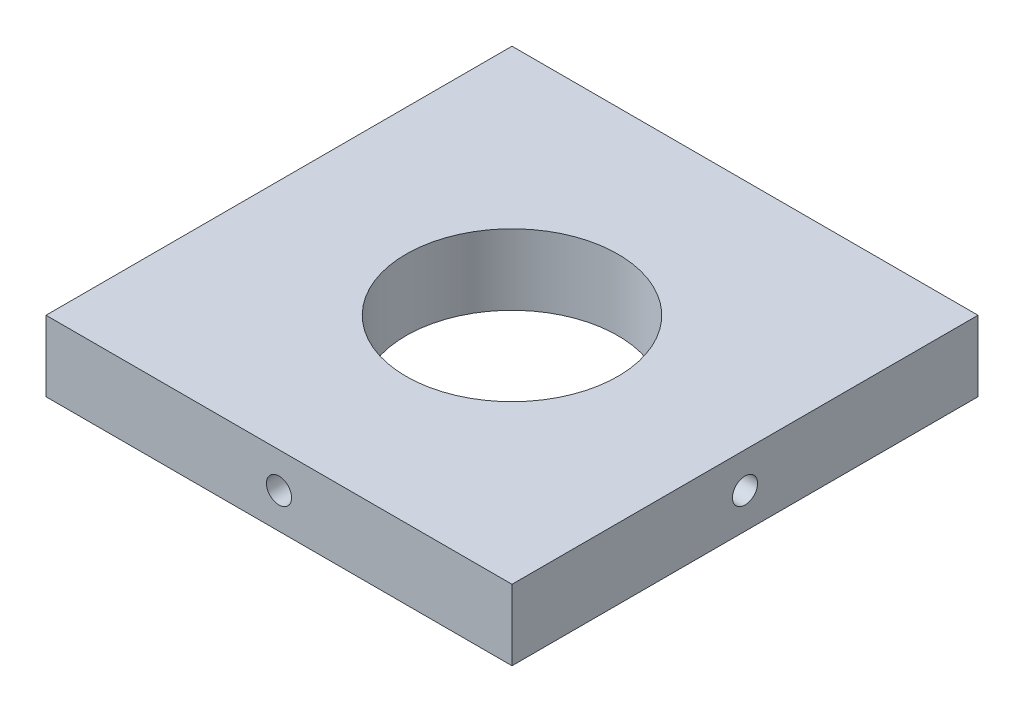
ISO-10303-21;
HEADER;
FILE_DESCRIPTION(('STEP AP214'),'2;1');
FILE_NAME('part.step','',(''),(''),'','','');
FILE_SCHEMA(('AUTOMOTIVE_DESIGN { 1 0 10303 214 1 1 1 1 }'));
ENDSEC;
DATA;
#1=APPLICATION_CONTEXT('core data for automotive mechanical design processes');
#2=APPLICATION_PROTOCOL_DEFINITION('international standard','automotive_design',2000,#1);
#3=PRODUCT_CONTEXT('',#1,'mechanical');
#4=PRODUCT('Part','Part','',(#3));
#5=PRODUCT_RELATED_PRODUCT_CATEGORY('part','',(#4));
#6=PRODUCT_DEFINITION_FORMATION('','',#4);
#7=PRODUCT_DEFINITION_CONTEXT('part definition',#1,'design');
#8=PRODUCT_DEFINITION('design','',#6,#7);
#9=PRODUCT_DEFINITION_SHAPE('','',#8);
#10=(LENGTH_UNIT() NAMED_UNIT(*) SI_UNIT(.MILLI.,.METRE.));
#11=(NAMED_UNIT(*) PLANE_ANGLE_UNIT() SI_UNIT($,.RADIAN.));
#12=(NAMED_UNIT(*) SI_UNIT($,.STERADIAN.) SOLID_ANGLE_UNIT());
#13=UNCERTAINTY_MEASURE_WITH_UNIT(LENGTH_MEASURE(1.E-05),#10,'distance_accuracy_value','');
#14=(GEOMETRIC_REPRESENTATION_CONTEXT(3) GLOBAL_UNCERTAINTY_ASSIGNED_CONTEXT((#13)) GLOBAL_UNIT_ASSIGNED_CONTEXT((#10,
#11,#12)) REPRESENTATION_CONTEXT('',''));
#15=CARTESIAN_POINT('',(0.,0.,0.));
#16=DIRECTION('',(0.,0.,1.));
#17=DIRECTION('',(1.,0.,0.));
#18=AXIS2_PLACEMENT_3D('',#15,#16,#17);
#19=CARTESIAN_POINT('',(0.,5.,0.));
#20=DIRECTION('',(0.,-1.,0.));
#21=DIRECTION('',(0.,0.,-1.));
#22=AXIS2_PLACEMENT_3D('',#19,#20,#21);
#23=PLANE('',#22);
#24=DIRECTION('',(0.,0.,1.));
#25=VECTOR('',#24,1.);
#26=CARTESIAN_POINT('',(-16.5,5.,16.5));
#27=LINE('',#26,#25);
#28=CARTESIAN_POINT('',(-16.5,5.,-16.5));
#29=VERTEX_POINT('',#28);
#30=CARTESIAN_POINT('',(-16.5,5.,16.5));
#31=VERTEX_POINT('',#30);
#32=EDGE_CURVE('E157',#29,#31,#27,.T.);
#33=ORIENTED_EDGE('',*,*,#32,.T.);
#34=DIRECTION('',(1.,0.,0.));
#35=VECTOR('',#34,1.);
#36=CARTESIAN_POINT('',(-16.5,5.,16.5));
#37=LINE('',#36,#35);
#38=CARTESIAN_POINT('',(16.5,5.,16.5));
#39=VERTEX_POINT('',#38);
#40=EDGE_CURVE('E93',#31,#39,#37,.T.);
#41=ORIENTED_EDGE('',*,*,#40,.T.);
#42=DIRECTION('',(0.,0.,-1.));
#43=VECTOR('',#42,1.);
#44=CARTESIAN_POINT('',(16.5,5.,16.5));
#45=LINE('',#44,#43);
#46=CARTESIAN_POINT('',(16.5,5.,-16.5));
#47=VERTEX_POINT('',#46);
#48=EDGE_CURVE('E162',#39,#47,#45,.T.);
#49=ORIENTED_EDGE('',*,*,#48,.T.);
#50=DIRECTION('',(-1.,0.,0.));
#51=VECTOR('',#50,1.);
#52=CARTESIAN_POINT('',(-16.5,5.,-16.5));
#53=LINE('',#52,#51);
#54=EDGE_CURVE('E62',#47,#29,#53,.T.);
#55=ORIENTED_EDGE('',*,*,#54,.T.);
#56=EDGE_LOOP('',(#33,#41,#49,#55));
#57=FACE_BOUND('',#56,.T.);
#58=CARTESIAN_POINT('',(0.,5.,0.));
#59=DIRECTION('',(0.,1.,0.));
#60=DIRECTION('',(0.,0.,1.));
#61=AXIS2_PLACEMENT_3D('',#58,#59,#60);
#62=CIRCLE('',#61,7.5);
#63=CARTESIAN_POINT('',(0.,5.,7.5));
#64=VERTEX_POINT('',#63);
#65=EDGE_CURVE('E149',#64,#64,#62,.T.);
#66=ORIENTED_EDGE('',*,*,#65,.F.);
#67=EDGE_LOOP('',(#66));
#68=FACE_BOUND('',#67,.T.);
#69=ADVANCED_FACE('F44',(#57,#68),#23,.F.);
#70=CARTESIAN_POINT('',(0.,0.,0.));
#71=DIRECTION('',(0.,-1.,0.));
#72=DIRECTION('',(0.,0.,-1.));
#73=AXIS2_PLACEMENT_3D('',#70,#71,#72);
#74=PLANE('',#73);
#75=DIRECTION('',(0.,0.,1.));
#76=VECTOR('',#75,1.);
#77=CARTESIAN_POINT('',(-16.5,0.,16.5));
#78=LINE('',#77,#76);
#79=CARTESIAN_POINT('',(-16.5,0.,-16.5));
#80=VERTEX_POINT('',#79);
#81=CARTESIAN_POINT('',(-16.5,0.,16.5));
#82=VERTEX_POINT('',#81);
#83=EDGE_CURVE('E153',#80,#82,#78,.T.);
#84=ORIENTED_EDGE('',*,*,#83,.F.);
#85=DIRECTION('',(-1.,0.,0.));
#86=VECTOR('',#85,1.);
#87=CARTESIAN_POINT('',(-16.5,0.,-16.5));
#88=LINE('',#87,#86);
#89=CARTESIAN_POINT('',(16.5,0.,-16.5));
#90=VERTEX_POINT('',#89);
#91=EDGE_CURVE('E86',#90,#80,#88,.T.);
#92=ORIENTED_EDGE('',*,*,#91,.F.);
#93=DIRECTION('',(0.,0.,-1.));
#94=VECTOR('',#93,1.);
#95=CARTESIAN_POINT('',(16.5,0.,16.5));
#96=LINE('',#95,#94);
#97=CARTESIAN_POINT('',(16.5,0.,16.5));
#98=VERTEX_POINT('',#97);
#99=EDGE_CURVE('E80',#98,#90,#96,.T.);
#100=ORIENTED_EDGE('',*,*,#99,.F.);
#101=DIRECTION('',(1.,0.,0.));
#102=VECTOR('',#101,1.);
#103=CARTESIAN_POINT('',(-16.5,0.,16.5));
#104=LINE('',#103,#102);
#105=EDGE_CURVE('E171',#82,#98,#104,.T.);
#106=ORIENTED_EDGE('',*,*,#105,.F.);
#107=EDGE_LOOP('',(#84,#92,#100,#106));
#108=FACE_BOUND('',#107,.T.);
#109=CARTESIAN_POINT('',(0.,0.,0.));
#110=DIRECTION('',(0.,1.,0.));
#111=DIRECTION('',(0.,0.,1.));
#112=AXIS2_PLACEMENT_3D('',#109,#110,#111);
#113=CIRCLE('',#112,7.5);
#114=CARTESIAN_POINT('',(0.,0.,7.5));
#115=VERTEX_POINT('',#114);
#116=EDGE_CURVE('E148',#115,#115,#113,.T.);
#117=ORIENTED_EDGE('',*,*,#116,.T.);
#118=EDGE_LOOP('',(#117));
#119=FACE_BOUND('',#118,.T.);
#120=ADVANCED_FACE('F188',(#108,#119),#74,.T.);
#121=CARTESIAN_POINT('',(-16.5,5.,16.5));
#122=DIRECTION('',(1.,0.,0.));
#123=DIRECTION('',(0.,0.,-1.));
#124=AXIS2_PLACEMENT_3D('',#121,#122,#123);
#125=PLANE('',#124);
#126=CARTESIAN_POINT('',(-16.5,2.5,0.));
#127=DIRECTION('',(-1.,0.,0.));
#128=DIRECTION('',(0.,0.,1.));
#129=AXIS2_PLACEMENT_3D('',#126,#127,#128);
#130=CIRCLE('',#129,0.888999999999989);
#131=CARTESIAN_POINT('',(-16.5,2.5,0.88899999999998));
#132=VERTEX_POINT('',#131);
#133=EDGE_CURVE('E118',#132,#132,#130,.T.);
#134=ORIENTED_EDGE('',*,*,#133,.F.);
#135=EDGE_LOOP('',(#134));
#136=FACE_BOUND('',#135,.T.);
#137=ORIENTED_EDGE('',*,*,#83,.T.);
#138=DIRECTION('',(0.,-1.,0.));
#139=VECTOR('',#138,1.);
#140=CARTESIAN_POINT('',(-16.5,5.,16.5));
#141=LINE('',#140,#139);
#142=EDGE_CURVE('E11',#31,#82,#141,.T.);
#143=ORIENTED_EDGE('',*,*,#142,.F.);
#144=ORIENTED_EDGE('',*,*,#32,.F.);
#145=DIRECTION('',(0.,-1.,0.));
#146=VECTOR('',#145,1.);
#147=CARTESIAN_POINT('',(-16.5,5.,-16.5));
#148=LINE('',#147,#146);
#149=EDGE_CURVE('E167',#29,#80,#148,.T.);
#150=ORIENTED_EDGE('',*,*,#149,.T.);
#151=EDGE_LOOP('',(#137,#143,#144,#150));
#152=FACE_BOUND('',#151,.T.);
#153=ADVANCED_FACE('F46',(#136,#152),#125,.F.);
#154=CARTESIAN_POINT('',(-16.5,5.,16.5));
#155=DIRECTION('',(0.,0.,-1.));
#156=DIRECTION('',(-1.,0.,0.));
#157=AXIS2_PLACEMENT_3D('',#154,#155,#156);
#158=PLANE('',#157);
#159=CARTESIAN_POINT('',(0.,2.5,16.5));
#160=DIRECTION('',(0.,0.,1.));
#161=DIRECTION('',(1.,0.,0.));
#162=AXIS2_PLACEMENT_3D('',#159,#160,#161);
#163=CIRCLE('',#162,0.888999999999989);
#164=CARTESIAN_POINT('',(0.888999999999985,2.5,16.5));
#165=VERTEX_POINT('',#164);
#166=EDGE_CURVE('E140',#165,#165,#163,.T.);
#167=ORIENTED_EDGE('',*,*,#166,.F.);
#168=EDGE_LOOP('',(#167));
#169=FACE_BOUND('',#168,.T.);
#170=ORIENTED_EDGE('',*,*,#105,.T.);
#171=DIRECTION('',(0.,-1.,0.));
#172=VECTOR('',#171,1.);
#173=CARTESIAN_POINT('',(16.5,5.,16.5));
#174=LINE('',#173,#172);
#175=EDGE_CURVE('E54',#39,#98,#174,.T.);
#176=ORIENTED_EDGE('',*,*,#175,.F.);
#177=ORIENTED_EDGE('',*,*,#40,.F.);
#178=ORIENTED_EDGE('',*,*,#142,.T.);
#179=EDGE_LOOP('',(#170,#176,#177,#178));
#180=FACE_BOUND('',#179,.T.);
#181=ADVANCED_FACE('F205',(#169,#180),#158,.F.);
#182=CARTESIAN_POINT('',(16.5,5.,16.5));
#183=DIRECTION('',(-1.,0.,0.));
#184=DIRECTION('',(0.,0.,1.));
#185=AXIS2_PLACEMENT_3D('',#182,#183,#184);
#186=PLANE('',#185);
#187=CARTESIAN_POINT('',(16.5,2.5,0.));
#188=DIRECTION('',(1.,0.,0.));
#189=DIRECTION('',(0.,0.,-1.));
#190=AXIS2_PLACEMENT_3D('',#187,#188,#189);
#191=CIRCLE('',#190,0.888999999999989);
#192=CARTESIAN_POINT('',(16.5,2.5,-0.888999999999985));
#193=VERTEX_POINT('',#192);
#194=EDGE_CURVE('E117',#193,#193,#191,.T.);
#195=ORIENTED_EDGE('',*,*,#194,.F.);
#196=EDGE_LOOP('',(#195));
#197=FACE_BOUND('',#196,.T.);
#198=ORIENTED_EDGE('',*,*,#99,.T.);
#199=DIRECTION('',(0.,-1.,0.));
#200=VECTOR('',#199,1.);
#201=CARTESIAN_POINT('',(16.5,5.,-16.5));
#202=LINE('',#201,#200);
#203=EDGE_CURVE('E180',#47,#90,#202,.T.);
#204=ORIENTED_EDGE('',*,*,#203,.F.);
#205=ORIENTED_EDGE('',*,*,#48,.F.);
#206=ORIENTED_EDGE('',*,*,#175,.T.);
#207=EDGE_LOOP('',(#198,#204,#205,#206));
#208=FACE_BOUND('',#207,.T.);
#209=ADVANCED_FACE('F185',(#197,#208),#186,.F.);
#210=CARTESIAN_POINT('',(-16.5,5.,-16.5));
#211=DIRECTION('',(0.,0.,1.));
#212=DIRECTION('',(1.,0.,0.));
#213=AXIS2_PLACEMENT_3D('',#210,#211,#212);
#214=PLANE('',#213);
#215=CARTESIAN_POINT('',(0.,2.5,-16.5));
#216=DIRECTION('',(0.,0.,-1.));
#217=DIRECTION('',(-1.,0.,0.));
#218=AXIS2_PLACEMENT_3D('',#215,#216,#217);
#219=CIRCLE('',#218,0.888999999999989);
#220=CARTESIAN_POINT('',(-0.888999999999992,2.5,-16.5));
#221=VERTEX_POINT('',#220);
#222=EDGE_CURVE('E132',#221,#221,#219,.T.);
#223=ORIENTED_EDGE('',*,*,#222,.F.);
#224=EDGE_LOOP('',(#223));
#225=FACE_BOUND('',#224,.T.);
#226=ORIENTED_EDGE('',*,*,#91,.T.);
#227=ORIENTED_EDGE('',*,*,#149,.F.);
#228=ORIENTED_EDGE('',*,*,#54,.F.);
#229=ORIENTED_EDGE('',*,*,#203,.T.);
#230=EDGE_LOOP('',(#226,#227,#228,#229));
#231=FACE_BOUND('',#230,.T.);
#232=ADVANCED_FACE('F193',(#225,#231),#214,.F.);
#233=CARTESIAN_POINT('',(0.,5.,0.));
#234=DIRECTION('',(0.,-1.,0.));
#235=DIRECTION('',(0.,0.,-1.));
#236=AXIS2_PLACEMENT_3D('',#233,#234,#235);
#237=CYLINDRICAL_SURFACE('',#236,7.5);
#238=ORIENTED_EDGE('',*,*,#65,.T.);
#239=EDGE_LOOP('',(#238));
#240=FACE_BOUND('',#239,.T.);
#241=ORIENTED_EDGE('',*,*,#116,.F.);
#242=EDGE_LOOP('',(#241));
#243=FACE_BOUND('',#242,.T.);
#244=ADVANCED_FACE('F195',(#240,#243),#237,.F.);
#245=CARTESIAN_POINT('',(0.,2.5,9.0341650903155));
#246=DIRECTION('',(0.,0.,1.));
#247=DIRECTION('',(1.,0.,0.));
#248=AXIS2_PLACEMENT_3D('',#245,#246,#247);
#249=CONICAL_SURFACE('',#248,0.888999999999998,1.02974425867665);
#250=CARTESIAN_POINT('',(0.,2.5,8.5));
#251=VERTEX_POINT('',#250);
#252=VERTEX_LOOP('',#251);
#253=FACE_BOUND('',#252,.T.);
#254=CARTESIAN_POINT('',(0.,2.5,9.0341650903155));
#255=DIRECTION('',(0.,0.,1.));
#256=DIRECTION('',(1.,0.,0.));
#257=AXIS2_PLACEMENT_3D('',#254,#255,#256);
#258=CIRCLE('',#257,0.888999999999998);
#259=CARTESIAN_POINT('',(0.888999999999995,2.5,9.0341650903155));
#260=VERTEX_POINT('',#259);
#261=EDGE_CURVE('E144',#260,#260,#258,.T.);
#262=ORIENTED_EDGE('',*,*,#261,.T.);
#263=EDGE_LOOP('',(#262));
#264=FACE_BOUND('',#263,.T.);
#265=ADVANCED_FACE('F202',(#253,#264),#249,.F.);
#266=CARTESIAN_POINT('',(0.,2.5,16.5));
#267=DIRECTION('',(0.,0.,1.));
#268=DIRECTION('',(1.,0.,0.));
#269=AXIS2_PLACEMENT_3D('',#266,#267,#268);
#270=CYLINDRICAL_SURFACE('',#269,0.888999999999994);
#271=ORIENTED_EDGE('',*,*,#261,.F.);
#272=EDGE_LOOP('',(#271));
#273=FACE_BOUND('',#272,.T.);
#274=ORIENTED_EDGE('',*,*,#166,.T.);
#275=EDGE_LOOP('',(#274));
#276=FACE_BOUND('',#275,.T.);
#277=ADVANCED_FACE('F219',(#273,#276),#270,.F.);
#278=CARTESIAN_POINT('',(0.,2.5,-9.0341650903155));
#279=DIRECTION('',(0.,0.,-1.));
#280=DIRECTION('',(-1.,0.,0.));
#281=AXIS2_PLACEMENT_3D('',#278,#279,#280);
#282=CONICAL_SURFACE('',#281,0.888999999999998,1.02974425867665);
#283=CARTESIAN_POINT('',(0.,2.5,-8.5));
#284=VERTEX_POINT('',#283);
#285=VERTEX_LOOP('',#284);
#286=FACE_BOUND('',#285,.T.);
#287=CARTESIAN_POINT('',(0.,2.5,-9.0341650903155));
#288=DIRECTION('',(0.,0.,-1.));
#289=DIRECTION('',(-1.,0.,0.));
#290=AXIS2_PLACEMENT_3D('',#287,#288,#289);
#291=CIRCLE('',#290,0.888999999999998);
#292=CARTESIAN_POINT('',(-0.889000000000001,2.5,-9.0341650903155));
#293=VERTEX_POINT('',#292);
#294=EDGE_CURVE('E136',#293,#293,#291,.T.);
#295=ORIENTED_EDGE('',*,*,#294,.T.);
#296=EDGE_LOOP('',(#295));
#297=FACE_BOUND('',#296,.T.);
#298=ADVANCED_FACE('F223',(#286,#297),#282,.F.);
#299=CARTESIAN_POINT('',(0.,2.5,-16.5));
#300=DIRECTION('',(0.,0.,-1.));
#301=DIRECTION('',(-1.,0.,0.));
#302=AXIS2_PLACEMENT_3D('',#299,#300,#301);
#303=CYLINDRICAL_SURFACE('',#302,0.888999999999993);
#304=ORIENTED_EDGE('',*,*,#294,.F.);
#305=EDGE_LOOP('',(#304));
#306=FACE_BOUND('',#305,.T.);
#307=ORIENTED_EDGE('',*,*,#222,.T.);
#308=EDGE_LOOP('',(#307));
#309=FACE_BOUND('',#308,.T.);
#310=ADVANCED_FACE('F227',(#306,#309),#303,.F.);
#311=CARTESIAN_POINT('',(9.0341650903155,2.5,0.));
#312=DIRECTION('',(1.,0.,0.));
#313=DIRECTION('',(0.,0.,-1.));
#314=AXIS2_PLACEMENT_3D('',#311,#312,#313);
#315=CONICAL_SURFACE('',#314,0.888999999999998,1.02974425867665);
#316=CARTESIAN_POINT('',(8.5,2.5,0.));
#317=VERTEX_POINT('',#316);
#318=VERTEX_LOOP('',#317);
#319=FACE_BOUND('',#318,.T.);
#320=CARTESIAN_POINT('',(9.0341650903155,2.5,0.));
#321=DIRECTION('',(1.,0.,0.));
#322=DIRECTION('',(0.,0.,-1.));
#323=AXIS2_PLACEMENT_3D('',#320,#321,#322);
#324=CIRCLE('',#323,0.888999999999998);
#325=CARTESIAN_POINT('',(9.0341650903155,2.5,-0.888999999999994));
#326=VERTEX_POINT('',#325);
#327=EDGE_CURVE('E124',#326,#326,#324,.T.);
#328=ORIENTED_EDGE('',*,*,#327,.T.);
#329=EDGE_LOOP('',(#328));
#330=FACE_BOUND('',#329,.T.);
#331=ADVANCED_FACE('F231',(#319,#330),#315,.F.);
#332=CARTESIAN_POINT('',(16.5,2.5,0.));
#333=DIRECTION('',(1.,0.,0.));
#334=DIRECTION('',(0.,0.,-1.));
#335=AXIS2_PLACEMENT_3D('',#332,#333,#334);
#336=CYLINDRICAL_SURFACE('',#335,0.888999999999993);
#337=ORIENTED_EDGE('',*,*,#327,.F.);
#338=EDGE_LOOP('',(#337));
#339=FACE_BOUND('',#338,.T.);
#340=ORIENTED_EDGE('',*,*,#194,.T.);
#341=EDGE_LOOP('',(#340));
#342=FACE_BOUND('',#341,.T.);
#343=ADVANCED_FACE('F110',(#339,#342),#336,.F.);
#344=CARTESIAN_POINT('',(-9.0341650903155,2.5,0.));
#345=DIRECTION('',(-1.,0.,0.));
#346=DIRECTION('',(0.,0.,1.));
#347=AXIS2_PLACEMENT_3D('',#344,#345,#346);
#348=CONICAL_SURFACE('',#347,0.888999999999998,1.02974425867665);
#349=CARTESIAN_POINT('',(-8.49999999999999,2.5,0.));
#350=VERTEX_POINT('',#349);
#351=VERTEX_LOOP('',#350);
#352=FACE_BOUND('',#351,.T.);
#353=CARTESIAN_POINT('',(-9.0341650903155,2.5,0.));
#354=DIRECTION('',(-1.,0.,0.));
#355=DIRECTION('',(0.,0.,1.));
#356=AXIS2_PLACEMENT_3D('',#353,#354,#355);
#357=CIRCLE('',#356,0.888999999999998);
#358=CARTESIAN_POINT('',(-9.0341650903155,2.5,0.888999999999992));
#359=VERTEX_POINT('',#358);
#360=EDGE_CURVE('E114',#359,#359,#357,.T.);
#361=ORIENTED_EDGE('',*,*,#360,.T.);
#362=EDGE_LOOP('',(#361));
#363=FACE_BOUND('',#362,.T.);
#364=ADVANCED_FACE('F106',(#352,#363),#348,.F.);
#365=CARTESIAN_POINT('',(-16.5,2.5,0.));
#366=DIRECTION('',(-1.,0.,0.));
#367=DIRECTION('',(0.,0.,1.));
#368=AXIS2_PLACEMENT_3D('',#365,#366,#367);
#369=CYLINDRICAL_SURFACE('',#368,0.888999999999993);
#370=ORIENTED_EDGE('',*,*,#360,.F.);
#371=EDGE_LOOP('',(#370));
#372=FACE_BOUND('',#371,.T.);
#373=ORIENTED_EDGE('',*,*,#133,.T.);
#374=EDGE_LOOP('',(#373));
#375=FACE_BOUND('',#374,.T.);
#376=ADVANCED_FACE('F109',(#372,#375),#369,.F.);
#377=CLOSED_SHELL('',(#69,#120,#153,#181,#209,#232,#244,#265,#277,#298,#310,#331,#343,#364,#376));
#378=MANIFOLD_SOLID_BREP('B2',#377);
#379=ADVANCED_BREP_SHAPE_REPRESENTATION('',(#18,#378),#14);
#380=SHAPE_DEFINITION_REPRESENTATION(#9,#379);
ENDSEC;
END-ISO-10303-21;
